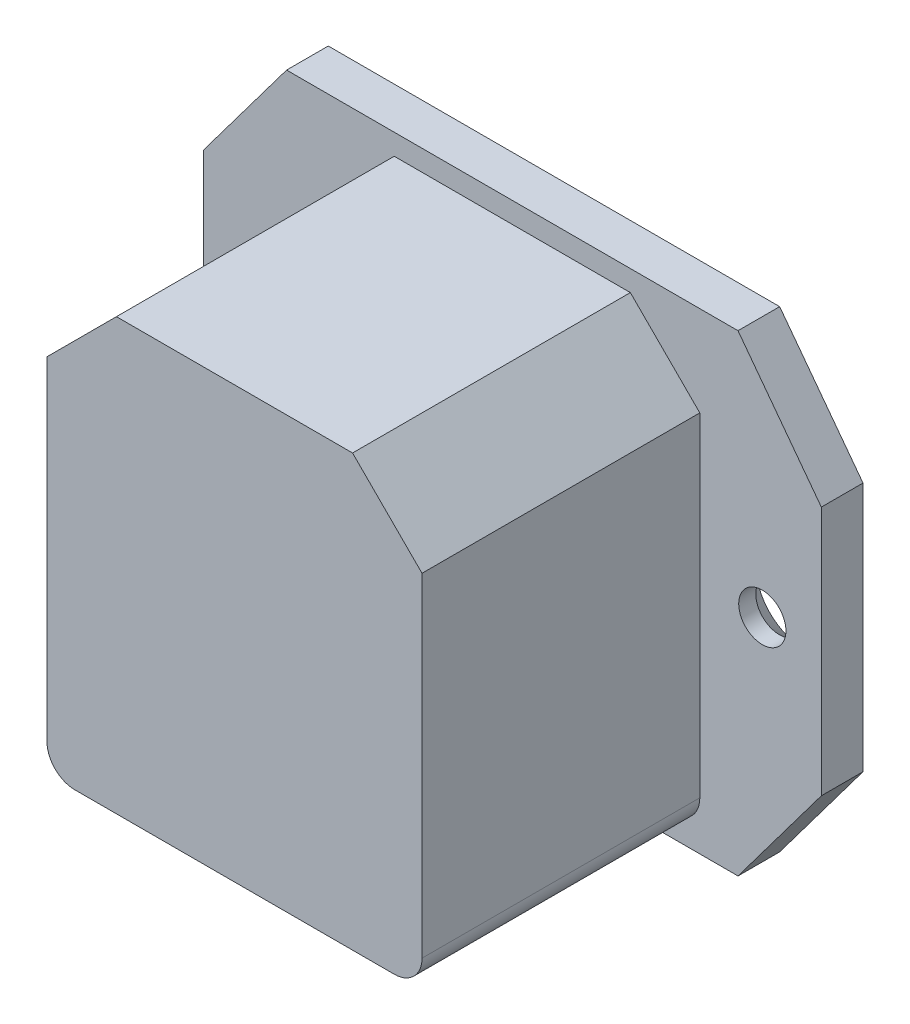
ISO-10303-21;
HEADER;
FILE_DESCRIPTION(('STEP AP214'),'2;1');
FILE_NAME('part.step','',(''),(''),'','','');
FILE_SCHEMA(('AUTOMOTIVE_DESIGN { 1 0 10303 214 1 1 1 1 }'));
ENDSEC;
DATA;
#1=APPLICATION_CONTEXT('core data for automotive mechanical design processes');
#2=APPLICATION_PROTOCOL_DEFINITION('international standard','automotive_design',2000,#1);
#3=PRODUCT_CONTEXT('',#1,'mechanical');
#4=PRODUCT('Part','Part','',(#3));
#5=PRODUCT_RELATED_PRODUCT_CATEGORY('part','',(#4));
#6=PRODUCT_DEFINITION_FORMATION('','',#4);
#7=PRODUCT_DEFINITION_CONTEXT('part definition',#1,'design');
#8=PRODUCT_DEFINITION('design','',#6,#7);
#9=PRODUCT_DEFINITION_SHAPE('','',#8);
#10=(LENGTH_UNIT() NAMED_UNIT(*) SI_UNIT(.MILLI.,.METRE.));
#11=(NAMED_UNIT(*) PLANE_ANGLE_UNIT() SI_UNIT($,.RADIAN.));
#12=(NAMED_UNIT(*) SI_UNIT($,.STERADIAN.) SOLID_ANGLE_UNIT());
#13=UNCERTAINTY_MEASURE_WITH_UNIT(LENGTH_MEASURE(1.E-05),#10,'distance_accuracy_value','');
#14=(GEOMETRIC_REPRESENTATION_CONTEXT(3) GLOBAL_UNCERTAINTY_ASSIGNED_CONTEXT((#13)) GLOBAL_UNIT_ASSIGNED_CONTEXT((#10,
#11,#12)) REPRESENTATION_CONTEXT('',''));
#15=CARTESIAN_POINT('',(0.,0.,0.));
#16=DIRECTION('',(0.,0.,1.));
#17=DIRECTION('',(1.,0.,0.));
#18=AXIS2_PLACEMENT_3D('',#15,#16,#17);
#19=CARTESIAN_POINT('',(0.,0.,-3.));
#20=DIRECTION('',(0.,0.,1.));
#21=DIRECTION('',(1.,0.,0.));
#22=AXIS2_PLACEMENT_3D('',#19,#20,#21);
#23=PLANE('',#22);
#24=DIRECTION('',(0.,-1.,0.));
#25=VECTOR('',#24,1.);
#26=CARTESIAN_POINT('',(12.25,9.,-3.));
#27=LINE('',#26,#25);
#28=CARTESIAN_POINT('',(12.25,9.,-3.));
#29=VERTEX_POINT('',#28);
#30=CARTESIAN_POINT('',(12.25,-2.,-3.));
#31=VERTEX_POINT('',#30);
#32=EDGE_CURVE('E225',#29,#31,#27,.T.);
#33=ORIENTED_EDGE('',*,*,#32,.F.);
#34=DIRECTION('',(0.707106781186548,-0.707106781186547,0.));
#35=VECTOR('',#34,1.);
#36=CARTESIAN_POINT('',(7.25,14.,-3.));
#37=LINE('',#36,#35);
#38=CARTESIAN_POINT('',(7.25,14.,-3.));
#39=VERTEX_POINT('',#38);
#40=EDGE_CURVE('E193',#39,#29,#37,.T.);
#41=ORIENTED_EDGE('',*,*,#40,.F.);
#42=DIRECTION('',(1.,0.,0.));
#43=VECTOR('',#42,1.);
#44=CARTESIAN_POINT('',(-7.25,14.,-3.));
#45=LINE('',#44,#43);
#46=CARTESIAN_POINT('',(-7.25,14.,-3.));
#47=VERTEX_POINT('',#46);
#48=EDGE_CURVE('E211',#47,#39,#45,.T.);
#49=ORIENTED_EDGE('',*,*,#48,.F.);
#50=DIRECTION('',(0.707106781186548,0.707106781186547,0.));
#51=VECTOR('',#50,1.);
#52=CARTESIAN_POINT('',(-7.25,14.,-3.));
#53=LINE('',#52,#51);
#54=CARTESIAN_POINT('',(-12.25,9.,-3.));
#55=VERTEX_POINT('',#54);
#56=EDGE_CURVE('E214',#55,#47,#53,.T.);
#57=ORIENTED_EDGE('',*,*,#56,.F.);
#58=DIRECTION('',(0.,1.,0.));
#59=VECTOR('',#58,1.);
#60=CARTESIAN_POINT('',(-12.25,9.,-3.));
#61=LINE('',#60,#59);
#62=CARTESIAN_POINT('',(-12.25,-2.,-3.));
#63=VERTEX_POINT('',#62);
#64=EDGE_CURVE('E230',#63,#55,#61,.T.);
#65=ORIENTED_EDGE('',*,*,#64,.F.);
#66=DIRECTION('',(-1.,0.,0.));
#67=VECTOR('',#66,1.);
#68=CARTESIAN_POINT('',(12.25,-2.,-3.));
#69=LINE('',#68,#67);
#70=EDGE_CURVE('E227',#31,#63,#69,.T.);
#71=ORIENTED_EDGE('',*,*,#70,.F.);
#72=EDGE_LOOP('',(#33,#41,#49,#57,#65,#71));
#73=FACE_BOUND('',#72,.T.);
#74=CARTESIAN_POINT('',(-18.,0.,-3.));
#75=DIRECTION('',(0.,0.,-1.));
#76=DIRECTION('',(-1.,0.,0.));
#77=AXIS2_PLACEMENT_3D('',#74,#75,#76);
#78=CIRCLE('',#77,3.47);
#79=CARTESIAN_POINT('',(-21.47,0.,-3.));
#80=VERTEX_POINT('',#79);
#81=EDGE_CURVE('E253',#80,#80,#78,.T.);
#82=ORIENTED_EDGE('',*,*,#81,.F.);
#83=EDGE_LOOP('',(#82));
#84=FACE_BOUND('',#83,.T.);
#85=DIRECTION('',(0.,-1.,0.));
#86=VECTOR('',#85,1.);
#87=CARTESIAN_POINT('',(-22.25,-9.,-3.));
#88=LINE('',#87,#86);
#89=CARTESIAN_POINT('',(-22.25,9.,-3.));
#90=VERTEX_POINT('',#89);
#91=CARTESIAN_POINT('',(-22.25,-9.,-3.));
#92=VERTEX_POINT('',#91);
#93=EDGE_CURVE('E263',#90,#92,#88,.T.);
#94=ORIENTED_EDGE('',*,*,#93,.F.);
#95=DIRECTION('',(-0.6,-0.8,0.));
#96=VECTOR('',#95,1.);
#97=CARTESIAN_POINT('',(-22.25,9.,-3.));
#98=LINE('',#97,#96);
#99=CARTESIAN_POINT('',(-16.25,17.,-3.));
#100=VERTEX_POINT('',#99);
#101=EDGE_CURVE('E285',#100,#90,#98,.T.);
#102=ORIENTED_EDGE('',*,*,#101,.F.);
#103=DIRECTION('',(-1.,0.,0.));
#104=VECTOR('',#103,1.);
#105=CARTESIAN_POINT('',(16.25,17.,-3.));
#106=LINE('',#105,#104);
#107=CARTESIAN_POINT('',(16.25,17.,-3.));
#108=VERTEX_POINT('',#107);
#109=EDGE_CURVE('E282',#108,#100,#106,.T.);
#110=ORIENTED_EDGE('',*,*,#109,.F.);
#111=DIRECTION('',(-0.6,0.8,0.));
#112=VECTOR('',#111,1.);
#113=CARTESIAN_POINT('',(22.25,9.,-3.));
#114=LINE('',#113,#112);
#115=CARTESIAN_POINT('',(22.25,9.,-3.));
#116=VERTEX_POINT('',#115);
#117=EDGE_CURVE('E279',#116,#108,#114,.T.);
#118=ORIENTED_EDGE('',*,*,#117,.F.);
#119=DIRECTION('',(0.,1.,0.));
#120=VECTOR('',#119,1.);
#121=CARTESIAN_POINT('',(22.25,-9.,-3.));
#122=LINE('',#121,#120);
#123=CARTESIAN_POINT('',(22.25,-9.,-3.));
#124=VERTEX_POINT('',#123);
#125=EDGE_CURVE('E276',#124,#116,#122,.T.);
#126=ORIENTED_EDGE('',*,*,#125,.F.);
#127=DIRECTION('',(0.6,0.8,0.));
#128=VECTOR('',#127,1.);
#129=CARTESIAN_POINT('',(22.25,-9.,-3.));
#130=LINE('',#129,#128);
#131=CARTESIAN_POINT('',(16.25,-17.,-3.));
#132=VERTEX_POINT('',#131);
#133=EDGE_CURVE('E273',#132,#124,#130,.T.);
#134=ORIENTED_EDGE('',*,*,#133,.F.);
#135=DIRECTION('',(1.,0.,0.));
#136=VECTOR('',#135,1.);
#137=CARTESIAN_POINT('',(16.25,-17.,-3.));
#138=LINE('',#137,#136);
#139=CARTESIAN_POINT('',(-16.25,-17.,-3.));
#140=VERTEX_POINT('',#139);
#141=EDGE_CURVE('E270',#140,#132,#138,.T.);
#142=ORIENTED_EDGE('',*,*,#141,.F.);
#143=DIRECTION('',(0.6,-0.8,0.));
#144=VECTOR('',#143,1.);
#145=CARTESIAN_POINT('',(-22.25,-9.,-3.));
#146=LINE('',#145,#144);
#147=EDGE_CURVE('E266',#92,#140,#146,.T.);
#148=ORIENTED_EDGE('',*,*,#147,.F.);
#149=EDGE_LOOP('',(#94,#102,#110,#118,#126,#134,#142,#148));
#150=FACE_BOUND('',#149,.T.);
#151=CARTESIAN_POINT('',(18.,0.,-3.));
#152=DIRECTION('',(0.,0.,-1.));
#153=DIRECTION('',(-1.,0.,0.));
#154=AXIS2_PLACEMENT_3D('',#151,#152,#153);
#155=CIRCLE('',#154,3.47);
#156=CARTESIAN_POINT('',(14.53,0.,-3.));
#157=VERTEX_POINT('',#156);
#158=EDGE_CURVE('E237',#157,#157,#155,.T.);
#159=ORIENTED_EDGE('',*,*,#158,.F.);
#160=EDGE_LOOP('',(#159));
#161=FACE_BOUND('',#160,.T.);
#162=ADVANCED_FACE('F37',(#73,#84,#150,#161),#23,.F.);
#163=CARTESIAN_POINT('',(13.5,-15.5,20.));
#164=DIRECTION('',(-1.,0.,0.));
#165=DIRECTION('',(0.,0.,1.));
#166=AXIS2_PLACEMENT_3D('',#163,#164,#165);
#167=PLANE('',#166);
#168=DIRECTION('',(0.,1.,0.));
#169=VECTOR('',#168,1.);
#170=CARTESIAN_POINT('',(13.5,-15.5,20.));
#171=LINE('',#170,#169);
#172=CARTESIAN_POINT('',(13.5,-13.5,20.));
#173=VERTEX_POINT('',#172);
#174=CARTESIAN_POINT('',(13.5,10.5,20.));
#175=VERTEX_POINT('',#174);
#176=EDGE_CURVE('E327',#173,#175,#171,.T.);
#177=ORIENTED_EDGE('',*,*,#176,.F.);
#178=DIRECTION('',(0.,0.,-1.));
#179=VECTOR('',#178,1.);
#180=CARTESIAN_POINT('',(13.5,-13.5,20.));
#181=LINE('',#180,#179);
#182=CARTESIAN_POINT('',(13.5,-13.5,0.));
#183=VERTEX_POINT('',#182);
#184=EDGE_CURVE('E366',#173,#183,#181,.T.);
#185=ORIENTED_EDGE('',*,*,#184,.T.);
#186=DIRECTION('',(0.,1.,0.));
#187=VECTOR('',#186,1.);
#188=CARTESIAN_POINT('',(13.5,-15.5,0.));
#189=LINE('',#188,#187);
#190=CARTESIAN_POINT('',(13.5,10.5,0.));
#191=VERTEX_POINT('',#190);
#192=EDGE_CURVE('E313',#183,#191,#189,.T.);
#193=ORIENTED_EDGE('',*,*,#192,.T.);
#194=DIRECTION('',(0.,0.,1.));
#195=VECTOR('',#194,1.);
#196=CARTESIAN_POINT('',(13.5,10.5,20.));
#197=LINE('',#196,#195);
#198=EDGE_CURVE('E351',#191,#175,#197,.T.);
#199=ORIENTED_EDGE('',*,*,#198,.T.);
#200=EDGE_LOOP('',(#177,#185,#193,#199));
#201=FACE_BOUND('',#200,.T.);
#202=ADVANCED_FACE('F393',(#201),#167,.F.);
#203=CARTESIAN_POINT('',(-13.5,15.5,20.));
#204=DIRECTION('',(0.,-1.,0.));
#205=DIRECTION('',(0.,0.,-1.));
#206=AXIS2_PLACEMENT_3D('',#203,#204,#205);
#207=PLANE('',#206);
#208=DIRECTION('',(-1.,0.,0.));
#209=VECTOR('',#208,1.);
#210=CARTESIAN_POINT('',(-13.5,15.5,20.));
#211=LINE('',#210,#209);
#212=CARTESIAN_POINT('',(8.5,15.5,20.));
#213=VERTEX_POINT('',#212);
#214=CARTESIAN_POINT('',(-8.49999999999998,15.5,20.));
#215=VERTEX_POINT('',#214);
#216=EDGE_CURVE('E329',#213,#215,#211,.T.);
#217=ORIENTED_EDGE('',*,*,#216,.F.);
#218=DIRECTION('',(0.,0.,-1.));
#219=VECTOR('',#218,1.);
#220=CARTESIAN_POINT('',(8.5,15.5,20.));
#221=LINE('',#220,#219);
#222=CARTESIAN_POINT('',(8.5,15.5,0.));
#223=VERTEX_POINT('',#222);
#224=EDGE_CURVE('E348',#213,#223,#221,.T.);
#225=ORIENTED_EDGE('',*,*,#224,.T.);
#226=DIRECTION('',(-1.,0.,0.));
#227=VECTOR('',#226,1.);
#228=CARTESIAN_POINT('',(-13.5,15.5,0.));
#229=LINE('',#228,#227);
#230=CARTESIAN_POINT('',(-8.49999999999998,15.5,0.));
#231=VERTEX_POINT('',#230);
#232=EDGE_CURVE('E340',#223,#231,#229,.T.);
#233=ORIENTED_EDGE('',*,*,#232,.T.);
#234=DIRECTION('',(0.,0.,1.));
#235=VECTOR('',#234,1.);
#236=CARTESIAN_POINT('',(-8.49999999999998,15.5,20.));
#237=LINE('',#236,#235);
#238=EDGE_CURVE('E338',#231,#215,#237,.T.);
#239=ORIENTED_EDGE('',*,*,#238,.T.);
#240=EDGE_LOOP('',(#217,#225,#233,#239));
#241=FACE_BOUND('',#240,.T.);
#242=ADVANCED_FACE('F402',(#241),#207,.F.);
#243=CARTESIAN_POINT('',(-13.5,-15.5,20.));
#244=DIRECTION('',(1.,0.,0.));
#245=DIRECTION('',(0.,0.,-1.));
#246=AXIS2_PLACEMENT_3D('',#243,#244,#245);
#247=PLANE('',#246);
#248=DIRECTION('',(0.,-1.,0.));
#249=VECTOR('',#248,1.);
#250=CARTESIAN_POINT('',(-13.5,-15.5,0.));
#251=LINE('',#250,#249);
#252=CARTESIAN_POINT('',(-13.5,10.5,0.));
#253=VERTEX_POINT('',#252);
#254=CARTESIAN_POINT('',(-13.5,-13.5,0.));
#255=VERTEX_POINT('',#254);
#256=EDGE_CURVE('E343',#253,#255,#251,.T.);
#257=ORIENTED_EDGE('',*,*,#256,.T.);
#258=DIRECTION('',(0.,0.,-1.));
#259=VECTOR('',#258,1.);
#260=CARTESIAN_POINT('',(-13.5,-13.5,20.));
#261=LINE('',#260,#259);
#262=CARTESIAN_POINT('',(-13.5,-13.5,20.));
#263=VERTEX_POINT('',#262);
#264=EDGE_CURVE('E57',#255,#263,#261,.F.);
#265=ORIENTED_EDGE('',*,*,#264,.T.);
#266=DIRECTION('',(0.,-1.,0.));
#267=VECTOR('',#266,1.);
#268=CARTESIAN_POINT('',(-13.5,-15.5,20.));
#269=LINE('',#268,#267);
#270=CARTESIAN_POINT('',(-13.5,10.5,20.));
#271=VERTEX_POINT('',#270);
#272=EDGE_CURVE('E333',#271,#263,#269,.T.);
#273=ORIENTED_EDGE('',*,*,#272,.F.);
#274=DIRECTION('',(0.,0.,-1.));
#275=VECTOR('',#274,1.);
#276=CARTESIAN_POINT('',(-13.5,10.5,20.));
#277=LINE('',#276,#275);
#278=EDGE_CURVE('E358',#271,#253,#277,.T.);
#279=ORIENTED_EDGE('',*,*,#278,.T.);
#280=EDGE_LOOP('',(#257,#265,#273,#279));
#281=FACE_BOUND('',#280,.T.);
#282=ADVANCED_FACE('F409',(#281),#247,.F.);
#283=CARTESIAN_POINT('',(-13.5,-15.5,20.));
#284=DIRECTION('',(0.,1.,0.));
#285=DIRECTION('',(0.,0.,1.));
#286=AXIS2_PLACEMENT_3D('',#283,#284,#285);
#287=PLANE('',#286);
#288=DIRECTION('',(1.,0.,0.));
#289=VECTOR('',#288,1.);
#290=CARTESIAN_POINT('',(-13.5,-15.5,0.));
#291=LINE('',#290,#289);
#292=CARTESIAN_POINT('',(-11.5,-15.5,0.));
#293=VERTEX_POINT('',#292);
#294=CARTESIAN_POINT('',(11.5,-15.5,0.));
#295=VERTEX_POINT('',#294);
#296=EDGE_CURVE('E330',#293,#295,#291,.T.);
#297=ORIENTED_EDGE('',*,*,#296,.T.);
#298=DIRECTION('',(0.,0.,-1.));
#299=VECTOR('',#298,1.);
#300=CARTESIAN_POINT('',(11.5,-15.5,20.));
#301=LINE('',#300,#299);
#302=CARTESIAN_POINT('',(11.5,-15.5,20.));
#303=VERTEX_POINT('',#302);
#304=EDGE_CURVE('E372',#295,#303,#301,.F.);
#305=ORIENTED_EDGE('',*,*,#304,.T.);
#306=DIRECTION('',(1.,0.,0.));
#307=VECTOR('',#306,1.);
#308=CARTESIAN_POINT('',(-13.5,-15.5,20.));
#309=LINE('',#308,#307);
#310=CARTESIAN_POINT('',(-11.5,-15.5,20.));
#311=VERTEX_POINT('',#310);
#312=EDGE_CURVE('E335',#311,#303,#309,.T.);
#313=ORIENTED_EDGE('',*,*,#312,.F.);
#314=DIRECTION('',(0.,0.,-1.));
#315=VECTOR('',#314,1.);
#316=CARTESIAN_POINT('',(-11.5,-15.5,20.));
#317=LINE('',#316,#315);
#318=EDGE_CURVE('E369',#311,#293,#317,.T.);
#319=ORIENTED_EDGE('',*,*,#318,.T.);
#320=EDGE_LOOP('',(#297,#305,#313,#319));
#321=FACE_BOUND('',#320,.T.);
#322=ADVANCED_FACE('F384',(#321),#287,.F.);
#323=CARTESIAN_POINT('',(0.,0.,20.));
#324=DIRECTION('',(0.,0.,-1.));
#325=DIRECTION('',(-1.,0.,0.));
#326=AXIS2_PLACEMENT_3D('',#323,#324,#325);
#327=PLANE('',#326);
#328=ORIENTED_EDGE('',*,*,#312,.T.);
#329=CARTESIAN_POINT('',(11.5,-13.5,20.));
#330=DIRECTION('',(0.,0.,-1.));
#331=DIRECTION('',(-1.,0.,0.));
#332=AXIS2_PLACEMENT_3D('',#329,#330,#331);
#333=CIRCLE('',#332,2.);
#334=EDGE_CURVE('E376',#303,#173,#333,.F.);
#335=ORIENTED_EDGE('',*,*,#334,.T.);
#336=ORIENTED_EDGE('',*,*,#176,.T.);
#337=DIRECTION('',(0.707106781186547,-0.707106781186549,0.));
#338=VECTOR('',#337,1.);
#339=CARTESIAN_POINT('',(8.5,15.5,20.));
#340=LINE('',#339,#338);
#341=EDGE_CURVE('E356',#175,#213,#340,.F.);
#342=ORIENTED_EDGE('',*,*,#341,.T.);
#343=ORIENTED_EDGE('',*,*,#216,.T.);
#344=DIRECTION('',(0.707106781186549,0.707106781186546,0.));
#345=VECTOR('',#344,1.);
#346=CARTESIAN_POINT('',(-13.5,10.5,20.));
#347=LINE('',#346,#345);
#348=EDGE_CURVE('E354',#215,#271,#347,.F.);
#349=ORIENTED_EDGE('',*,*,#348,.T.);
#350=ORIENTED_EDGE('',*,*,#272,.T.);
#351=CARTESIAN_POINT('',(-11.5,-13.5,20.));
#352=DIRECTION('',(0.,0.,-1.));
#353=DIRECTION('',(-1.,0.,0.));
#354=AXIS2_PLACEMENT_3D('',#351,#352,#353);
#355=CIRCLE('',#354,2.);
#356=EDGE_CURVE('E374',#263,#311,#355,.F.);
#357=ORIENTED_EDGE('',*,*,#356,.T.);
#358=EDGE_LOOP('',(#328,#335,#336,#342,#343,#349,#350,#357));
#359=FACE_BOUND('',#358,.T.);
#360=ADVANCED_FACE('F391',(#359),#327,.F.);
#361=CARTESIAN_POINT('',(0.,0.,0.));
#362=DIRECTION('',(0.,0.,1.));
#363=DIRECTION('',(1.,0.,0.));
#364=AXIS2_PLACEMENT_3D('',#361,#362,#363);
#365=PLANE('',#364);
#366=CARTESIAN_POINT('',(18.,0.,0.));
#367=DIRECTION('',(0.,0.,1.));
#368=DIRECTION('',(1.,0.,0.));
#369=AXIS2_PLACEMENT_3D('',#366,#367,#368);
#370=CIRCLE('',#369,1.7);
#371=CARTESIAN_POINT('',(19.7,0.,0.));
#372=VERTEX_POINT('',#371);
#373=EDGE_CURVE('E250',#372,#372,#370,.T.);
#374=ORIENTED_EDGE('',*,*,#373,.F.);
#375=EDGE_LOOP('',(#374));
#376=FACE_BOUND('',#375,.T.);
#377=CARTESIAN_POINT('',(-18.,0.,0.));
#378=DIRECTION('',(0.,0.,1.));
#379=DIRECTION('',(1.,0.,0.));
#380=AXIS2_PLACEMENT_3D('',#377,#378,#379);
#381=CIRCLE('',#380,1.7);
#382=CARTESIAN_POINT('',(-16.3,0.,0.));
#383=VERTEX_POINT('',#382);
#384=EDGE_CURVE('E259',#383,#383,#381,.T.);
#385=ORIENTED_EDGE('',*,*,#384,.F.);
#386=EDGE_LOOP('',(#385));
#387=FACE_BOUND('',#386,.T.);
#388=DIRECTION('',(0.,-1.,0.));
#389=VECTOR('',#388,1.);
#390=CARTESIAN_POINT('',(-22.25,-9.,0.));
#391=LINE('',#390,#389);
#392=CARTESIAN_POINT('',(-22.25,9.,0.));
#393=VERTEX_POINT('',#392);
#394=CARTESIAN_POINT('',(-22.25,-9.,0.));
#395=VERTEX_POINT('',#394);
#396=EDGE_CURVE('E262',#393,#395,#391,.T.);
#397=ORIENTED_EDGE('',*,*,#396,.T.);
#398=DIRECTION('',(0.6,-0.8,0.));
#399=VECTOR('',#398,1.);
#400=CARTESIAN_POINT('',(-22.25,-9.,0.));
#401=LINE('',#400,#399);
#402=CARTESIAN_POINT('',(-16.25,-17.,0.));
#403=VERTEX_POINT('',#402);
#404=EDGE_CURVE('E291',#395,#403,#401,.T.);
#405=ORIENTED_EDGE('',*,*,#404,.T.);
#406=DIRECTION('',(1.,0.,0.));
#407=VECTOR('',#406,1.);
#408=CARTESIAN_POINT('',(16.25,-17.,0.));
#409=LINE('',#408,#407);
#410=CARTESIAN_POINT('',(16.25,-17.,0.));
#411=VERTEX_POINT('',#410);
#412=EDGE_CURVE('E294',#403,#411,#409,.T.);
#413=ORIENTED_EDGE('',*,*,#412,.T.);
#414=DIRECTION('',(0.6,0.8,0.));
#415=VECTOR('',#414,1.);
#416=CARTESIAN_POINT('',(22.25,-9.,0.));
#417=LINE('',#416,#415);
#418=CARTESIAN_POINT('',(22.25,-9.,0.));
#419=VERTEX_POINT('',#418);
#420=EDGE_CURVE('E297',#411,#419,#417,.T.);
#421=ORIENTED_EDGE('',*,*,#420,.T.);
#422=DIRECTION('',(0.,1.,0.));
#423=VECTOR('',#422,1.);
#424=CARTESIAN_POINT('',(22.25,-9.,0.));
#425=LINE('',#424,#423);
#426=CARTESIAN_POINT('',(22.25,9.,0.));
#427=VERTEX_POINT('',#426);
#428=EDGE_CURVE('E300',#419,#427,#425,.T.);
#429=ORIENTED_EDGE('',*,*,#428,.T.);
#430=DIRECTION('',(-0.6,0.8,0.));
#431=VECTOR('',#430,1.);
#432=CARTESIAN_POINT('',(22.25,9.,0.));
#433=LINE('',#432,#431);
#434=CARTESIAN_POINT('',(16.25,17.,0.));
#435=VERTEX_POINT('',#434);
#436=EDGE_CURVE('E303',#427,#435,#433,.T.);
#437=ORIENTED_EDGE('',*,*,#436,.T.);
#438=DIRECTION('',(-1.,0.,0.));
#439=VECTOR('',#438,1.);
#440=CARTESIAN_POINT('',(16.25,17.,0.));
#441=LINE('',#440,#439);
#442=CARTESIAN_POINT('',(-16.25,17.,0.));
#443=VERTEX_POINT('',#442);
#444=EDGE_CURVE('E306',#435,#443,#441,.T.);
#445=ORIENTED_EDGE('',*,*,#444,.T.);
#446=DIRECTION('',(-0.6,-0.8,0.));
#447=VECTOR('',#446,1.);
#448=CARTESIAN_POINT('',(-22.25,9.,0.));
#449=LINE('',#448,#447);
#450=EDGE_CURVE('E267',#443,#393,#449,.T.);
#451=ORIENTED_EDGE('',*,*,#450,.T.);
#452=EDGE_LOOP('',(#397,#405,#413,#421,#429,#437,#445,#451));
#453=FACE_BOUND('',#452,.T.);
#454=ORIENTED_EDGE('',*,*,#192,.F.);
#455=CARTESIAN_POINT('',(11.5,-13.5,0.));
#456=DIRECTION('',(0.,0.,1.));
#457=DIRECTION('',(1.,0.,0.));
#458=AXIS2_PLACEMENT_3D('',#455,#456,#457);
#459=CIRCLE('',#458,2.);
#460=EDGE_CURVE('E45',#183,#295,#459,.F.);
#461=ORIENTED_EDGE('',*,*,#460,.T.);
#462=ORIENTED_EDGE('',*,*,#296,.F.);
#463=CARTESIAN_POINT('',(-11.5,-13.5,0.));
#464=DIRECTION('',(0.,0.,1.));
#465=DIRECTION('',(1.,0.,0.));
#466=AXIS2_PLACEMENT_3D('',#463,#464,#465);
#467=CIRCLE('',#466,2.);
#468=EDGE_CURVE('E11',#293,#255,#467,.F.);
#469=ORIENTED_EDGE('',*,*,#468,.T.);
#470=ORIENTED_EDGE('',*,*,#256,.F.);
#471=DIRECTION('',(-0.707106781186549,-0.707106781186546,0.));
#472=VECTOR('',#471,1.);
#473=CARTESIAN_POINT('',(-13.5,10.5,0.));
#474=LINE('',#473,#472);
#475=EDGE_CURVE('E364',#253,#231,#474,.F.);
#476=ORIENTED_EDGE('',*,*,#475,.T.);
#477=ORIENTED_EDGE('',*,*,#232,.F.);
#478=DIRECTION('',(-0.707106781186547,0.707106781186549,0.));
#479=VECTOR('',#478,1.);
#480=CARTESIAN_POINT('',(8.5,15.5,0.));
#481=LINE('',#480,#479);
#482=EDGE_CURVE('E361',#223,#191,#481,.F.);
#483=ORIENTED_EDGE('',*,*,#482,.T.);
#484=EDGE_LOOP('',(#454,#461,#462,#469,#470,#476,#477,#483));
#485=FACE_BOUND('',#484,.T.);
#486=ADVANCED_FACE('F379',(#376,#387,#453,#485),#365,.T.);
#487=CARTESIAN_POINT('',(-22.25,-9.,-3.));
#488=DIRECTION('',(-1.,0.,0.));
#489=DIRECTION('',(0.,0.,1.));
#490=AXIS2_PLACEMENT_3D('',#487,#488,#489);
#491=PLANE('',#490);
#492=ORIENTED_EDGE('',*,*,#396,.F.);
#493=DIRECTION('',(0.,0.,1.));
#494=VECTOR('',#493,1.);
#495=CARTESIAN_POINT('',(-22.25,9.,-3.));
#496=LINE('',#495,#494);
#497=EDGE_CURVE('E311',#90,#393,#496,.T.);
#498=ORIENTED_EDGE('',*,*,#497,.F.);
#499=ORIENTED_EDGE('',*,*,#93,.T.);
#500=DIRECTION('',(0.,0.,1.));
#501=VECTOR('',#500,1.);
#502=CARTESIAN_POINT('',(-22.25,-9.,-3.));
#503=LINE('',#502,#501);
#504=EDGE_CURVE('E288',#92,#395,#503,.T.);
#505=ORIENTED_EDGE('',*,*,#504,.T.);
#506=EDGE_LOOP('',(#492,#498,#499,#505));
#507=FACE_BOUND('',#506,.T.);
#508=ADVANCED_FACE('F429',(#507),#491,.T.);
#509=CARTESIAN_POINT('',(-22.25,9.,-3.));
#510=DIRECTION('',(-0.8,0.6,0.));
#511=DIRECTION('',(-0.6,-0.8,0.));
#512=AXIS2_PLACEMENT_3D('',#509,#510,#511);
#513=PLANE('',#512);
#514=ORIENTED_EDGE('',*,*,#450,.F.);
#515=DIRECTION('',(0.,0.,1.));
#516=VECTOR('',#515,1.);
#517=CARTESIAN_POINT('',(-16.25,17.,-3.));
#518=LINE('',#517,#516);
#519=EDGE_CURVE('E314',#100,#443,#518,.T.);
#520=ORIENTED_EDGE('',*,*,#519,.F.);
#521=ORIENTED_EDGE('',*,*,#101,.T.);
#522=ORIENTED_EDGE('',*,*,#497,.T.);
#523=EDGE_LOOP('',(#514,#520,#521,#522));
#524=FACE_BOUND('',#523,.T.);
#525=ADVANCED_FACE('F431',(#524),#513,.T.);
#526=CARTESIAN_POINT('',(16.25,17.,-3.));
#527=DIRECTION('',(0.,1.,0.));
#528=DIRECTION('',(0.,0.,1.));
#529=AXIS2_PLACEMENT_3D('',#526,#527,#528);
#530=PLANE('',#529);
#531=ORIENTED_EDGE('',*,*,#444,.F.);
#532=DIRECTION('',(0.,0.,1.));
#533=VECTOR('',#532,1.);
#534=CARTESIAN_POINT('',(16.25,17.,-3.));
#535=LINE('',#534,#533);
#536=EDGE_CURVE('E316',#108,#435,#535,.T.);
#537=ORIENTED_EDGE('',*,*,#536,.F.);
#538=ORIENTED_EDGE('',*,*,#109,.T.);
#539=ORIENTED_EDGE('',*,*,#519,.T.);
#540=EDGE_LOOP('',(#531,#537,#538,#539));
#541=FACE_BOUND('',#540,.T.);
#542=ADVANCED_FACE('F434',(#541),#530,.T.);
#543=CARTESIAN_POINT('',(22.25,9.,-3.));
#544=DIRECTION('',(0.8,0.6,0.));
#545=DIRECTION('',(-0.6,0.8,0.));
#546=AXIS2_PLACEMENT_3D('',#543,#544,#545);
#547=PLANE('',#546);
#548=ORIENTED_EDGE('',*,*,#436,.F.);
#549=DIRECTION('',(0.,0.,1.));
#550=VECTOR('',#549,1.);
#551=CARTESIAN_POINT('',(22.25,9.,-3.));
#552=LINE('',#551,#550);
#553=EDGE_CURVE('E318',#116,#427,#552,.T.);
#554=ORIENTED_EDGE('',*,*,#553,.F.);
#555=ORIENTED_EDGE('',*,*,#117,.T.);
#556=ORIENTED_EDGE('',*,*,#536,.T.);
#557=EDGE_LOOP('',(#548,#554,#555,#556));
#558=FACE_BOUND('',#557,.T.);
#559=ADVANCED_FACE('F438',(#558),#547,.T.);
#560=CARTESIAN_POINT('',(22.25,-9.,-3.));
#561=DIRECTION('',(1.,0.,0.));
#562=DIRECTION('',(0.,0.,-1.));
#563=AXIS2_PLACEMENT_3D('',#560,#561,#562);
#564=PLANE('',#563);
#565=ORIENTED_EDGE('',*,*,#428,.F.);
#566=DIRECTION('',(0.,0.,1.));
#567=VECTOR('',#566,1.);
#568=CARTESIAN_POINT('',(22.25,-9.,-3.));
#569=LINE('',#568,#567);
#570=EDGE_CURVE('E320',#124,#419,#569,.T.);
#571=ORIENTED_EDGE('',*,*,#570,.F.);
#572=ORIENTED_EDGE('',*,*,#125,.T.);
#573=ORIENTED_EDGE('',*,*,#553,.T.);
#574=EDGE_LOOP('',(#565,#571,#572,#573));
#575=FACE_BOUND('',#574,.T.);
#576=ADVANCED_FACE('F442',(#575),#564,.T.);
#577=CARTESIAN_POINT('',(22.25,-9.,-3.));
#578=DIRECTION('',(0.8,-0.6,0.));
#579=DIRECTION('',(0.6,0.8,0.));
#580=AXIS2_PLACEMENT_3D('',#577,#578,#579);
#581=PLANE('',#580);
#582=ORIENTED_EDGE('',*,*,#420,.F.);
#583=DIRECTION('',(0.,0.,1.));
#584=VECTOR('',#583,1.);
#585=CARTESIAN_POINT('',(16.25,-17.,-3.));
#586=LINE('',#585,#584);
#587=EDGE_CURVE('E322',#132,#411,#586,.T.);
#588=ORIENTED_EDGE('',*,*,#587,.F.);
#589=ORIENTED_EDGE('',*,*,#133,.T.);
#590=ORIENTED_EDGE('',*,*,#570,.T.);
#591=EDGE_LOOP('',(#582,#588,#589,#590));
#592=FACE_BOUND('',#591,.T.);
#593=ADVANCED_FACE('F446',(#592),#581,.T.);
#594=CARTESIAN_POINT('',(16.25,-17.,-3.));
#595=DIRECTION('',(0.,-1.,0.));
#596=DIRECTION('',(0.,0.,-1.));
#597=AXIS2_PLACEMENT_3D('',#594,#595,#596);
#598=PLANE('',#597);
#599=ORIENTED_EDGE('',*,*,#412,.F.);
#600=DIRECTION('',(0.,0.,1.));
#601=VECTOR('',#600,1.);
#602=CARTESIAN_POINT('',(-16.25,-17.,-3.));
#603=LINE('',#602,#601);
#604=EDGE_CURVE('E324',#140,#403,#603,.T.);
#605=ORIENTED_EDGE('',*,*,#604,.F.);
#606=ORIENTED_EDGE('',*,*,#141,.T.);
#607=ORIENTED_EDGE('',*,*,#587,.T.);
#608=EDGE_LOOP('',(#599,#605,#606,#607));
#609=FACE_BOUND('',#608,.T.);
#610=ADVANCED_FACE('F450',(#609),#598,.T.);
#611=CARTESIAN_POINT('',(-22.25,-9.,-3.));
#612=DIRECTION('',(-0.8,-0.6,0.));
#613=DIRECTION('',(0.6,-0.8,0.));
#614=AXIS2_PLACEMENT_3D('',#611,#612,#613);
#615=PLANE('',#614);
#616=ORIENTED_EDGE('',*,*,#404,.F.);
#617=ORIENTED_EDGE('',*,*,#504,.F.);
#618=ORIENTED_EDGE('',*,*,#147,.T.);
#619=ORIENTED_EDGE('',*,*,#604,.T.);
#620=EDGE_LOOP('',(#616,#617,#618,#619));
#621=FACE_BOUND('',#620,.T.);
#622=ADVANCED_FACE('F454',(#621),#615,.T.);
#623=CARTESIAN_POINT('',(-18.,0.,-3.));
#624=DIRECTION('',(0.,0.,-1.));
#625=DIRECTION('',(-1.,0.,0.));
#626=AXIS2_PLACEMENT_3D('',#623,#624,#625);
#627=CYLINDRICAL_SURFACE('',#626,1.7);
#628=CARTESIAN_POINT('',(-18.,0.,-1.23));
#629=DIRECTION('',(0.,0.,-1.));
#630=DIRECTION('',(-1.,0.,0.));
#631=AXIS2_PLACEMENT_3D('',#628,#629,#630);
#632=CIRCLE('',#631,1.7);
#633=CARTESIAN_POINT('',(-19.7,0.,-1.23));
#634=VERTEX_POINT('',#633);
#635=EDGE_CURVE('E256',#634,#634,#632,.T.);
#636=ORIENTED_EDGE('',*,*,#635,.T.);
#637=EDGE_LOOP('',(#636));
#638=FACE_BOUND('',#637,.T.);
#639=ORIENTED_EDGE('',*,*,#384,.T.);
#640=EDGE_LOOP('',(#639));
#641=FACE_BOUND('',#640,.T.);
#642=ADVANCED_FACE('F425',(#638,#641),#627,.F.);
#643=CARTESIAN_POINT('',(-18.,0.,-3.));
#644=DIRECTION('',(0.,0.,-1.));
#645=DIRECTION('',(-1.,0.,0.));
#646=AXIS2_PLACEMENT_3D('',#643,#644,#645);
#647=CONICAL_SURFACE('',#646,3.47,0.785398163397448);
#648=ORIENTED_EDGE('',*,*,#635,.F.);
#649=EDGE_LOOP('',(#648));
#650=FACE_BOUND('',#649,.T.);
#651=ORIENTED_EDGE('',*,*,#81,.T.);
#652=EDGE_LOOP('',(#651));
#653=FACE_BOUND('',#652,.T.);
#654=ADVANCED_FACE('F605',(#650,#653),#647,.F.);
#655=CARTESIAN_POINT('',(18.,0.,-3.));
#656=DIRECTION('',(0.,0.,-1.));
#657=DIRECTION('',(-1.,0.,0.));
#658=AXIS2_PLACEMENT_3D('',#655,#656,#657);
#659=CYLINDRICAL_SURFACE('',#658,1.7);
#660=CARTESIAN_POINT('',(18.,0.,-1.23));
#661=DIRECTION('',(0.,0.,-1.));
#662=DIRECTION('',(-1.,0.,0.));
#663=AXIS2_PLACEMENT_3D('',#660,#661,#662);
#664=CIRCLE('',#663,1.7);
#665=CARTESIAN_POINT('',(16.3,0.,-1.23));
#666=VERTEX_POINT('',#665);
#667=EDGE_CURVE('E247',#666,#666,#664,.T.);
#668=ORIENTED_EDGE('',*,*,#667,.T.);
#669=EDGE_LOOP('',(#668));
#670=FACE_BOUND('',#669,.T.);
#671=ORIENTED_EDGE('',*,*,#373,.T.);
#672=EDGE_LOOP('',(#671));
#673=FACE_BOUND('',#672,.T.);
#674=ADVANCED_FACE('F596',(#670,#673),#659,.F.);
#675=CARTESIAN_POINT('',(18.,0.,-3.));
#676=DIRECTION('',(0.,0.,-1.));
#677=DIRECTION('',(-1.,0.,0.));
#678=AXIS2_PLACEMENT_3D('',#675,#676,#677);
#679=CONICAL_SURFACE('',#678,3.47,0.785398163397448);
#680=ORIENTED_EDGE('',*,*,#667,.F.);
#681=EDGE_LOOP('',(#680));
#682=FACE_BOUND('',#681,.T.);
#683=ORIENTED_EDGE('',*,*,#158,.T.);
#684=EDGE_LOOP('',(#683));
#685=FACE_BOUND('',#684,.T.);
#686=ADVANCED_FACE('F588',(#682,#685),#679,.F.);
#687=CARTESIAN_POINT('',(7.25,14.,15.));
#688=DIRECTION('',(0.707106781186547,0.707106781186548,0.));
#689=DIRECTION('',(-0.707106781186548,0.707106781186547,0.));
#690=AXIS2_PLACEMENT_3D('',#687,#688,#689);
#691=PLANE('',#690);
#692=ORIENTED_EDGE('',*,*,#40,.T.);
#693=DIRECTION('',(0.,0.,-1.));
#694=VECTOR('',#693,1.);
#695=CARTESIAN_POINT('',(12.25,9.,15.));
#696=LINE('',#695,#694);
#697=CARTESIAN_POINT('',(12.25,9.,15.));
#698=VERTEX_POINT('',#697);
#699=EDGE_CURVE('E186',#698,#29,#696,.T.);
#700=ORIENTED_EDGE('',*,*,#699,.F.);
#701=DIRECTION('',(0.707106781186548,-0.707106781186547,0.));
#702=VECTOR('',#701,1.);
#703=CARTESIAN_POINT('',(7.25,14.,15.));
#704=LINE('',#703,#702);
#705=CARTESIAN_POINT('',(7.25,14.,15.));
#706=VERTEX_POINT('',#705);
#707=EDGE_CURVE('E190',#706,#698,#704,.T.);
#708=ORIENTED_EDGE('',*,*,#707,.F.);
#709=DIRECTION('',(0.,0.,-1.));
#710=VECTOR('',#709,1.);
#711=CARTESIAN_POINT('',(7.25,14.,15.));
#712=LINE('',#711,#710);
#713=EDGE_CURVE('E235',#706,#39,#712,.T.);
#714=ORIENTED_EDGE('',*,*,#713,.T.);
#715=EDGE_LOOP('',(#692,#700,#708,#714));
#716=FACE_BOUND('',#715,.T.);
#717=ADVANCED_FACE('F188',(#716),#691,.F.);
#718=CARTESIAN_POINT('',(-7.25,14.,15.));
#719=DIRECTION('',(0.,1.,0.));
#720=DIRECTION('',(0.,0.,1.));
#721=AXIS2_PLACEMENT_3D('',#718,#719,#720);
#722=PLANE('',#721);
#723=ORIENTED_EDGE('',*,*,#48,.T.);
#724=ORIENTED_EDGE('',*,*,#713,.F.);
#725=DIRECTION('',(1.,0.,0.));
#726=VECTOR('',#725,1.);
#727=CARTESIAN_POINT('',(-7.25,14.,15.));
#728=LINE('',#727,#726);
#729=CARTESIAN_POINT('',(-7.25,14.,15.));
#730=VERTEX_POINT('',#729);
#731=EDGE_CURVE('E198',#730,#706,#728,.T.);
#732=ORIENTED_EDGE('',*,*,#731,.F.);
#733=DIRECTION('',(0.,0.,-1.));
#734=VECTOR('',#733,1.);
#735=CARTESIAN_POINT('',(-7.25,14.,15.));
#736=LINE('',#735,#734);
#737=EDGE_CURVE('E238',#730,#47,#736,.T.);
#738=ORIENTED_EDGE('',*,*,#737,.T.);
#739=EDGE_LOOP('',(#723,#724,#732,#738));
#740=FACE_BOUND('',#739,.T.);
#741=ADVANCED_FACE('F571',(#740),#722,.F.);
#742=CARTESIAN_POINT('',(-7.25,14.,15.));
#743=DIRECTION('',(-0.707106781186547,0.707106781186548,0.));
#744=DIRECTION('',(-0.707106781186548,-0.707106781186547,0.));
#745=AXIS2_PLACEMENT_3D('',#742,#743,#744);
#746=PLANE('',#745);
#747=ORIENTED_EDGE('',*,*,#56,.T.);
#748=ORIENTED_EDGE('',*,*,#737,.F.);
#749=DIRECTION('',(0.707106781186548,0.707106781186547,0.));
#750=VECTOR('',#749,1.);
#751=CARTESIAN_POINT('',(-7.25,14.,15.));
#752=LINE('',#751,#750);
#753=CARTESIAN_POINT('',(-12.25,9.,15.));
#754=VERTEX_POINT('',#753);
#755=EDGE_CURVE('E221',#754,#730,#752,.T.);
#756=ORIENTED_EDGE('',*,*,#755,.F.);
#757=DIRECTION('',(0.,0.,-1.));
#758=VECTOR('',#757,1.);
#759=CARTESIAN_POINT('',(-12.25,9.,15.));
#760=LINE('',#759,#758);
#761=EDGE_CURVE('E240',#754,#55,#760,.T.);
#762=ORIENTED_EDGE('',*,*,#761,.T.);
#763=EDGE_LOOP('',(#747,#748,#756,#762));
#764=FACE_BOUND('',#763,.T.);
#765=ADVANCED_FACE('F562',(#764),#746,.F.);
#766=CARTESIAN_POINT('',(-12.25,9.,15.));
#767=DIRECTION('',(-1.,0.,0.));
#768=DIRECTION('',(0.,-1.,0.));
#769=AXIS2_PLACEMENT_3D('',#766,#767,#768);
#770=PLANE('',#769);
#771=ORIENTED_EDGE('',*,*,#64,.T.);
#772=ORIENTED_EDGE('',*,*,#761,.F.);
#773=DIRECTION('',(0.,1.,0.));
#774=VECTOR('',#773,1.);
#775=CARTESIAN_POINT('',(-12.25,9.,15.));
#776=LINE('',#775,#774);
#777=CARTESIAN_POINT('',(-12.25,-2.,15.));
#778=VERTEX_POINT('',#777);
#779=EDGE_CURVE('E218',#778,#754,#776,.T.);
#780=ORIENTED_EDGE('',*,*,#779,.F.);
#781=DIRECTION('',(0.,0.,-1.));
#782=VECTOR('',#781,1.);
#783=CARTESIAN_POINT('',(-12.25,-2.,15.));
#784=LINE('',#783,#782);
#785=EDGE_CURVE('E242',#778,#63,#784,.T.);
#786=ORIENTED_EDGE('',*,*,#785,.T.);
#787=EDGE_LOOP('',(#771,#772,#780,#786));
#788=FACE_BOUND('',#787,.T.);
#789=ADVANCED_FACE('F553',(#788),#770,.F.);
#790=CARTESIAN_POINT('',(12.25,-2.,15.));
#791=DIRECTION('',(0.,-1.,0.));
#792=DIRECTION('',(0.,0.,-1.));
#793=AXIS2_PLACEMENT_3D('',#790,#791,#792);
#794=PLANE('',#793);
#795=ORIENTED_EDGE('',*,*,#70,.T.);
#796=ORIENTED_EDGE('',*,*,#785,.F.);
#797=DIRECTION('',(-1.,0.,0.));
#798=VECTOR('',#797,1.);
#799=CARTESIAN_POINT('',(12.25,-2.,15.));
#800=LINE('',#799,#798);
#801=CARTESIAN_POINT('',(12.25,-2.,15.));
#802=VERTEX_POINT('',#801);
#803=EDGE_CURVE('E206',#802,#778,#800,.T.);
#804=ORIENTED_EDGE('',*,*,#803,.F.);
#805=DIRECTION('',(0.,0.,-1.));
#806=VECTOR('',#805,1.);
#807=CARTESIAN_POINT('',(12.25,-2.,15.));
#808=LINE('',#807,#806);
#809=EDGE_CURVE('E197',#802,#31,#808,.T.);
#810=ORIENTED_EDGE('',*,*,#809,.T.);
#811=EDGE_LOOP('',(#795,#796,#804,#810));
#812=FACE_BOUND('',#811,.T.);
#813=ADVANCED_FACE('F545',(#812),#794,.F.);
#814=CARTESIAN_POINT('',(12.25,9.,15.));
#815=DIRECTION('',(1.,0.,0.));
#816=DIRECTION('',(0.,1.,0.));
#817=AXIS2_PLACEMENT_3D('',#814,#815,#816);
#818=PLANE('',#817);
#819=ORIENTED_EDGE('',*,*,#32,.T.);
#820=ORIENTED_EDGE('',*,*,#809,.F.);
#821=DIRECTION('',(0.,-1.,0.));
#822=VECTOR('',#821,1.);
#823=CARTESIAN_POINT('',(12.25,9.,15.));
#824=LINE('',#823,#822);
#825=EDGE_CURVE('E201',#698,#802,#824,.T.);
#826=ORIENTED_EDGE('',*,*,#825,.F.);
#827=ORIENTED_EDGE('',*,*,#699,.T.);
#828=EDGE_LOOP('',(#819,#820,#826,#827));
#829=FACE_BOUND('',#828,.T.);
#830=ADVANCED_FACE('F202',(#829),#818,.F.);
#831=CARTESIAN_POINT('',(0.,0.,15.));
#832=DIRECTION('',(0.,0.,-1.));
#833=DIRECTION('',(-1.,0.,0.));
#834=AXIS2_PLACEMENT_3D('',#831,#832,#833);
#835=PLANE('',#834);
#836=ORIENTED_EDGE('',*,*,#707,.T.);
#837=ORIENTED_EDGE('',*,*,#825,.T.);
#838=ORIENTED_EDGE('',*,*,#803,.T.);
#839=ORIENTED_EDGE('',*,*,#779,.T.);
#840=ORIENTED_EDGE('',*,*,#755,.T.);
#841=ORIENTED_EDGE('',*,*,#731,.T.);
#842=EDGE_LOOP('',(#836,#837,#838,#839,#840,#841));
#843=FACE_BOUND('',#842,.T.);
#844=ADVANCED_FACE('F208',(#843),#835,.T.);
#845=CARTESIAN_POINT('',(8.5,15.5,20.));
#846=DIRECTION('',(-0.707106781186548,-0.707106781186546,0.));
#847=DIRECTION('',(0.,0.,-1.));
#848=AXIS2_PLACEMENT_3D('',#845,#846,#847);
#849=PLANE('',#848);
#850=ORIENTED_EDGE('',*,*,#341,.F.);
#851=ORIENTED_EDGE('',*,*,#198,.F.);
#852=ORIENTED_EDGE('',*,*,#482,.F.);
#853=ORIENTED_EDGE('',*,*,#224,.F.);
#854=EDGE_LOOP('',(#850,#851,#852,#853));
#855=FACE_BOUND('',#854,.T.);
#856=ADVANCED_FACE('F398',(#855),#849,.F.);
#857=CARTESIAN_POINT('',(-13.5,10.5,20.));
#858=DIRECTION('',(0.707106781186546,-0.707106781186549,0.));
#859=DIRECTION('',(0.,0.,-1.));
#860=AXIS2_PLACEMENT_3D('',#857,#858,#859);
#861=PLANE('',#860);
#862=ORIENTED_EDGE('',*,*,#348,.F.);
#863=ORIENTED_EDGE('',*,*,#238,.F.);
#864=ORIENTED_EDGE('',*,*,#475,.F.);
#865=ORIENTED_EDGE('',*,*,#278,.F.);
#866=EDGE_LOOP('',(#862,#863,#864,#865));
#867=FACE_BOUND('',#866,.T.);
#868=ADVANCED_FACE('F406',(#867),#861,.F.);
#869=CARTESIAN_POINT('',(11.5,-13.5,20.));
#870=DIRECTION('',(0.,0.,-1.));
#871=DIRECTION('',(-1.,0.,0.));
#872=AXIS2_PLACEMENT_3D('',#869,#870,#871);
#873=CYLINDRICAL_SURFACE('',#872,2.);
#874=ORIENTED_EDGE('',*,*,#334,.F.);
#875=ORIENTED_EDGE('',*,*,#304,.F.);
#876=ORIENTED_EDGE('',*,*,#460,.F.);
#877=ORIENTED_EDGE('',*,*,#184,.F.);
#878=EDGE_LOOP('',(#874,#875,#876,#877));
#879=FACE_BOUND('',#878,.T.);
#880=ADVANCED_FACE('F388',(#879),#873,.T.);
#881=CARTESIAN_POINT('',(-11.5,-13.5,20.));
#882=DIRECTION('',(0.,0.,-1.));
#883=DIRECTION('',(-1.,0.,0.));
#884=AXIS2_PLACEMENT_3D('',#881,#882,#883);
#885=CYLINDRICAL_SURFACE('',#884,2.);
#886=ORIENTED_EDGE('',*,*,#356,.F.);
#887=ORIENTED_EDGE('',*,*,#264,.F.);
#888=ORIENTED_EDGE('',*,*,#468,.F.);
#889=ORIENTED_EDGE('',*,*,#318,.F.);
#890=EDGE_LOOP('',(#886,#887,#888,#889));
#891=FACE_BOUND('',#890,.T.);
#892=ADVANCED_FACE('F39',(#891),#885,.T.);
#893=CLOSED_SHELL('',(#162,#202,#242,#282,#322,#360,#486,#508,#525,#542,#559,#576,#593,#610,
#622,#642,#654,#674,#686,#717,#741,#765,#789,#813,#830,#844,#856,#868,#880,#892));
#894=MANIFOLD_SOLID_BREP('B2',#893);
#895=ADVANCED_BREP_SHAPE_REPRESENTATION('',(#18,#894),#14);
#896=SHAPE_DEFINITION_REPRESENTATION(#9,#895);
ENDSEC;
END-ISO-10303-21;
